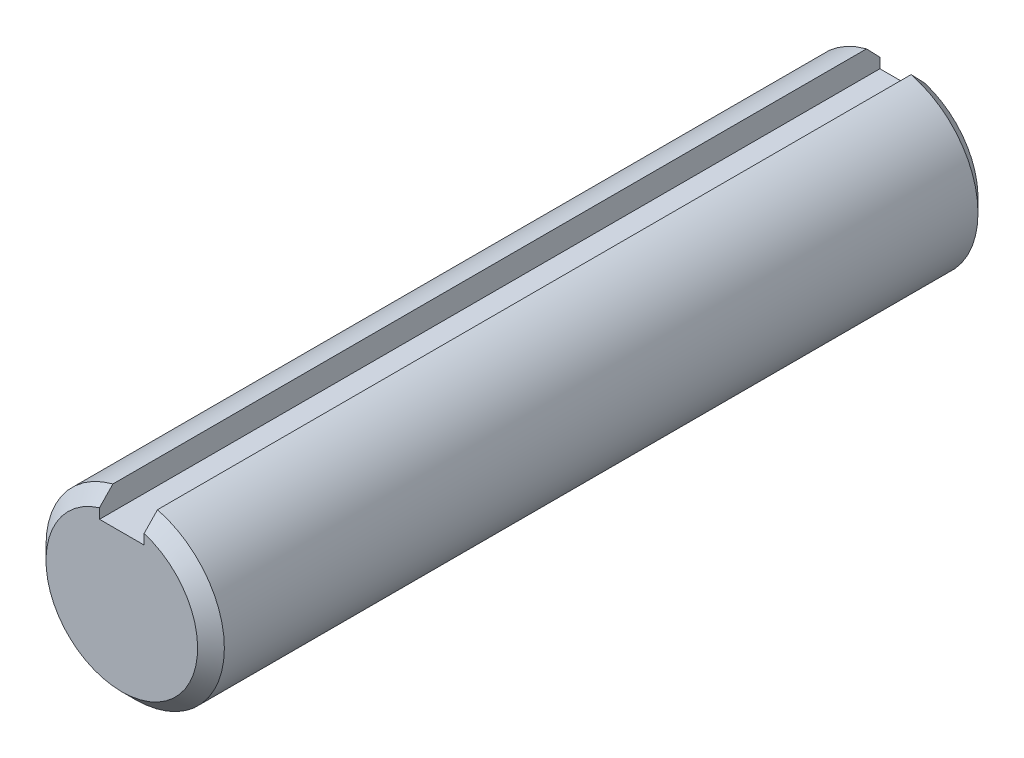
ISO-10303-21;
HEADER;
FILE_DESCRIPTION(('STEP AP214'),'2;1');
FILE_NAME('part.step','',(''),(''),'','','');
FILE_SCHEMA(('AUTOMOTIVE_DESIGN { 1 0 10303 214 1 1 1 1 }'));
ENDSEC;
DATA;
#1=APPLICATION_CONTEXT('core data for automotive mechanical design processes');
#2=APPLICATION_PROTOCOL_DEFINITION('international standard','automotive_design',2000,#1);
#3=PRODUCT_CONTEXT('',#1,'mechanical');
#4=PRODUCT('Part','Part','',(#3));
#5=PRODUCT_RELATED_PRODUCT_CATEGORY('part','',(#4));
#6=PRODUCT_DEFINITION_FORMATION('','',#4);
#7=PRODUCT_DEFINITION_CONTEXT('part definition',#1,'design');
#8=PRODUCT_DEFINITION('design','',#6,#7);
#9=PRODUCT_DEFINITION_SHAPE('','',#8);
#10=(LENGTH_UNIT() NAMED_UNIT(*) SI_UNIT(.MILLI.,.METRE.));
#11=(NAMED_UNIT(*) PLANE_ANGLE_UNIT() SI_UNIT($,.RADIAN.));
#12=(NAMED_UNIT(*) SI_UNIT($,.STERADIAN.) SOLID_ANGLE_UNIT());
#13=UNCERTAINTY_MEASURE_WITH_UNIT(LENGTH_MEASURE(1.E-05),#10,'distance_accuracy_value','');
#14=(GEOMETRIC_REPRESENTATION_CONTEXT(3) GLOBAL_UNCERTAINTY_ASSIGNED_CONTEXT((#13)) GLOBAL_UNIT_ASSIGNED_CONTEXT((#10,
#11,#12)) REPRESENTATION_CONTEXT('',''));
#15=CARTESIAN_POINT('',(0.,0.,0.));
#16=DIRECTION('',(0.,0.,1.));
#17=DIRECTION('',(1.,0.,0.));
#18=AXIS2_PLACEMENT_3D('',#15,#16,#17);
#19=CARTESIAN_POINT('',(0.,0.,17.5));
#20=DIRECTION('',(0.,0.,-1.));
#21=DIRECTION('',(-1.,0.,0.));
#22=AXIS2_PLACEMENT_3D('',#19,#20,#21);
#23=CYLINDRICAL_SURFACE('',#22,4.);
#24=CARTESIAN_POINT('',(0.,0.,16.9));
#25=DIRECTION('',(0.,0.,1.));
#26=DIRECTION('',(1.,0.,0.));
#27=AXIS2_PLACEMENT_3D('',#24,#25,#26);
#28=CIRCLE('',#27,4.);
#29=CARTESIAN_POINT('',(1.,3.87298334620742,16.9));
#30=VERTEX_POINT('',#29);
#31=CARTESIAN_POINT('',(-1.,3.87298334620742,16.9));
#32=VERTEX_POINT('',#31);
#33=EDGE_CURVE('E152',#30,#32,#28,.F.);
#34=ORIENTED_EDGE('',*,*,#33,.T.);
#35=DIRECTION('',(0.,0.,-1.));
#36=VECTOR('',#35,1.);
#37=CARTESIAN_POINT('',(-1.,3.87298334620742,17.5));
#38=LINE('',#37,#36);
#39=CARTESIAN_POINT('',(-1.,3.87298334620742,-16.9));
#40=VERTEX_POINT('',#39);
#41=EDGE_CURVE('E130',#32,#40,#38,.T.);
#42=ORIENTED_EDGE('',*,*,#41,.T.);
#43=CARTESIAN_POINT('',(0.,0.,-16.9));
#44=DIRECTION('',(0.,0.,1.));
#45=DIRECTION('',(1.,0.,0.));
#46=AXIS2_PLACEMENT_3D('',#43,#44,#45);
#47=CIRCLE('',#46,4.);
#48=CARTESIAN_POINT('',(1.,3.87298334620742,-16.9));
#49=VERTEX_POINT('',#48);
#50=EDGE_CURVE('E149',#40,#49,#47,.T.);
#51=ORIENTED_EDGE('',*,*,#50,.T.);
#52=DIRECTION('',(0.,0.,-1.));
#53=VECTOR('',#52,1.);
#54=CARTESIAN_POINT('',(1.,3.87298334620742,17.5));
#55=LINE('',#54,#53);
#56=EDGE_CURVE('E120',#49,#30,#55,.F.);
#57=ORIENTED_EDGE('',*,*,#56,.T.);
#58=EDGE_LOOP('',(#34,#42,#51,#57));
#59=FACE_BOUND('',#58,.T.);
#60=ADVANCED_FACE('F35',(#59),#23,.T.);
#61=CARTESIAN_POINT('',(0.,0.,17.5));
#62=DIRECTION('',(0.,0.,1.));
#63=DIRECTION('',(1.,0.,0.));
#64=AXIS2_PLACEMENT_3D('',#61,#62,#63);
#65=PLANE('',#64);
#66=DIRECTION('',(0.,-1.,0.));
#67=VECTOR('',#66,1.);
#68=CARTESIAN_POINT('',(-1.,4.,17.5));
#69=LINE('',#68,#67);
#70=CARTESIAN_POINT('',(-1.,3.24961536185438,17.5));
#71=VERTEX_POINT('',#70);
#72=CARTESIAN_POINT('',(-1.,2.8,17.5));
#73=VERTEX_POINT('',#72);
#74=EDGE_CURVE('E90',#71,#73,#69,.T.);
#75=ORIENTED_EDGE('',*,*,#74,.F.);
#76=CARTESIAN_POINT('',(0.,0.,17.5));
#77=DIRECTION('',(0.,0.,1.));
#78=DIRECTION('',(1.,0.,0.));
#79=AXIS2_PLACEMENT_3D('',#76,#77,#78);
#80=CIRCLE('',#79,3.4);
#81=CARTESIAN_POINT('',(1.,3.24961536185438,17.5));
#82=VERTEX_POINT('',#81);
#83=EDGE_CURVE('E144',#71,#82,#80,.T.);
#84=ORIENTED_EDGE('',*,*,#83,.T.);
#85=DIRECTION('',(0.,1.,0.));
#86=VECTOR('',#85,1.);
#87=CARTESIAN_POINT('',(1.,4.,17.5));
#88=LINE('',#87,#86);
#89=CARTESIAN_POINT('',(1.,2.8,17.5));
#90=VERTEX_POINT('',#89);
#91=EDGE_CURVE('E55',#90,#82,#88,.T.);
#92=ORIENTED_EDGE('',*,*,#91,.F.);
#93=DIRECTION('',(1.,0.,0.));
#94=VECTOR('',#93,1.);
#95=CARTESIAN_POINT('',(-1.,2.8,17.5));
#96=LINE('',#95,#94);
#97=EDGE_CURVE('E100',#73,#90,#96,.T.);
#98=ORIENTED_EDGE('',*,*,#97,.F.);
#99=EDGE_LOOP('',(#75,#84,#92,#98));
#100=FACE_BOUND('',#99,.T.);
#101=ADVANCED_FACE('F111',(#100),#65,.T.);
#102=CARTESIAN_POINT('',(0.,0.,-17.5));
#103=DIRECTION('',(0.,0.,1.));
#104=DIRECTION('',(1.,0.,0.));
#105=AXIS2_PLACEMENT_3D('',#102,#103,#104);
#106=PLANE('',#105);
#107=CARTESIAN_POINT('',(0.,0.,-17.5));
#108=DIRECTION('',(0.,0.,1.));
#109=DIRECTION('',(1.,0.,0.));
#110=AXIS2_PLACEMENT_3D('',#107,#108,#109);
#111=CIRCLE('',#110,3.39999999999999);
#112=CARTESIAN_POINT('',(1.,3.24961536185437,-17.5));
#113=VERTEX_POINT('',#112);
#114=CARTESIAN_POINT('',(-1.,3.24961536185437,-17.5));
#115=VERTEX_POINT('',#114);
#116=EDGE_CURVE('E146',#113,#115,#111,.F.);
#117=ORIENTED_EDGE('',*,*,#116,.T.);
#118=DIRECTION('',(0.,-1.,0.));
#119=VECTOR('',#118,1.);
#120=CARTESIAN_POINT('',(-1.,4.,-17.5));
#121=LINE('',#120,#119);
#122=CARTESIAN_POINT('',(-1.,2.8,-17.5));
#123=VERTEX_POINT('',#122);
#124=EDGE_CURVE('E113',#115,#123,#121,.T.);
#125=ORIENTED_EDGE('',*,*,#124,.T.);
#126=DIRECTION('',(1.,0.,0.));
#127=VECTOR('',#126,1.);
#128=CARTESIAN_POINT('',(-1.,2.8,-17.5));
#129=LINE('',#128,#127);
#130=CARTESIAN_POINT('',(1.,2.8,-17.5));
#131=VERTEX_POINT('',#130);
#132=EDGE_CURVE('E106',#123,#131,#129,.T.);
#133=ORIENTED_EDGE('',*,*,#132,.T.);
#134=DIRECTION('',(0.,1.,0.));
#135=VECTOR('',#134,1.);
#136=CARTESIAN_POINT('',(1.,4.,-17.5));
#137=LINE('',#136,#135);
#138=EDGE_CURVE('E109',#131,#113,#137,.T.);
#139=ORIENTED_EDGE('',*,*,#138,.T.);
#140=EDGE_LOOP('',(#117,#125,#133,#139));
#141=FACE_BOUND('',#140,.T.);
#142=ADVANCED_FACE('F163',(#141),#106,.F.);
#143=CARTESIAN_POINT('',(0.,0.,-16.9));
#144=DIRECTION('',(0.,0.,1.));
#145=DIRECTION('',(1.,0.,0.));
#146=AXIS2_PLACEMENT_3D('',#143,#144,#145);
#147=CONICAL_SURFACE('',#146,4.,0.785398163397448);
#148=CARTESIAN_POINT('',(-1.,1.35081586044512,-19.2193145776707));
#149=CARTESIAN_POINT('',(-1.,1.41488066306063,-19.1677819180893));
#150=CARTESIAN_POINT('',(-1.,1.47834718315388,-19.1155190121442));
#151=CARTESIAN_POINT('',(-1.,1.60431909726052,-19.0098610895691));
#152=CARTESIAN_POINT('',(-1.,1.66682460819919,-18.9564662125761));
#153=CARTESIAN_POINT('',(-1.,1.79110830645551,-18.8488748489054));
#154=CARTESIAN_POINT('',(-1.,1.85288669062793,-18.7946785885892));
#155=CARTESIAN_POINT('',(-1.,1.97588779267709,-18.6856554471097));
#156=CARTESIAN_POINT('',(-1.,2.03711049082799,-18.6308285437153));
#157=CARTESIAN_POINT('',(-1.,2.22007183752193,-18.4656732576281));
#158=CARTESIAN_POINT('',(-1.,2.34115805740112,-18.3546228023411));
#159=CARTESIAN_POINT('',(-1.,2.58220273418877,-18.1312938836685));
#160=CARTESIAN_POINT('',(-1.,2.70216111581648,-18.0190153393776));
#161=CARTESIAN_POINT('',(-1.,2.90589091931234,-17.8269857063987));
#162=CARTESIAN_POINT('',(-1.,2.98986154396475,-17.7474457040524));
#163=CARTESIAN_POINT('',(-1.,3.15749767385886,-17.5880337926722));
#164=CARTESIAN_POINT('',(-1.,3.24116315833901,-17.5081618618169));
#165=CARTESIAN_POINT('',(-1.,3.48509842555487,-17.2745671002813));
#166=CARTESIAN_POINT('',(-1.,3.64503682524598,-17.1204983050087));
#167=CARTESIAN_POINT('',(-1.,3.96429640051124,-16.811722329736));
#168=CARTESIAN_POINT('',(-1.,4.1236175738643,-16.6570151474428));
#169=CARTESIAN_POINT('',(-1.,4.44177985420495,-16.3471885210976));
#170=CARTESIAN_POINT('',(-1.,4.60062107239222,-16.1920691911779));
#171=CARTESIAN_POINT('',(-1.,4.91797030091099,-15.8814935510322));
#172=CARTESIAN_POINT('',(-1.,5.07647831497418,-15.7260372446202));
#173=CARTESIAN_POINT('',(-1.,5.23487471717617,-15.5704678156023));
#174=B_SPLINE_CURVE_WITH_KNOTS('',3,(#148,#149,#150,#151,#152,#153,#154,#155,#156,#157,#158,
#159,#160,#161,#162,#163,#164,#165,#166,#167,#168,#169,#170,#171,#172,#173),.UNSPECIFIED.,.F.,
.F.,(4,2,2,2,2,2,2,2,2,2,2,2,4),(0.,0.246638527108011,0.493246804550317,0.73978670666486,
0.98633532653122,1.47921612753496,1.97212959697097,2.31911430749398,2.66612220192963,
3.332345371537,3.99857093633251,4.6646280446703,5.33067765339345),.UNSPECIFIED.);
#175=EDGE_CURVE('E63',#115,#40,#174,.T.);
#176=ORIENTED_EDGE('',*,*,#175,.F.);
#177=ORIENTED_EDGE('',*,*,#116,.F.);
#178=CARTESIAN_POINT('',(1.,5.23487471717617,-15.5704678156023));
#179=CARTESIAN_POINT('',(1.,5.07642976511734,-15.7260850635911));
#180=CARTESIAN_POINT('',(1.,4.91787303822036,-15.8815890063281));
#181=CARTESIAN_POINT('',(1.,4.60043442524243,-16.1922515783813));
#182=CARTESIAN_POINT('',(1.,4.44155255272162,-16.3474102215566));
#183=CARTESIAN_POINT('',(1.,4.12339792056105,-16.6572286939957));
#184=CARTESIAN_POINT('',(1.,3.96412529582628,-16.8118886617124));
#185=CARTESIAN_POINT('',(1.,3.64495454195615,-17.1205770374935));
#186=CARTESIAN_POINT('',(1.,3.48505638500136,-17.2746054168307));
#187=CARTESIAN_POINT('',(1.,3.16427810361861,-17.5817896736052));
#188=CARTESIAN_POINT('',(1.,3.00339754942277,-17.7349451025749));
#189=CARTESIAN_POINT('',(1.,2.68026393133356,-18.0397741705045));
#190=CARTESIAN_POINT('',(1.,2.51801101305171,-18.1914479630795));
#191=CARTESIAN_POINT('',(1.,2.27284509960379,-18.4170936253633));
#192=CARTESIAN_POINT('',(1.,2.19080682391783,-18.4920145563211));
#193=CARTESIAN_POINT('',(1.,2.02594222380101,-18.6409764949062));
#194=CARTESIAN_POINT('',(1.,1.94311594332784,-18.7150175511038));
#195=CARTESIAN_POINT('',(1.,1.77634824406914,-18.8619013656389));
#196=CARTESIAN_POINT('',(1.,1.69240642828068,-18.9347436755316));
#197=CARTESIAN_POINT('',(1.,1.56532637426185,-19.0426501770363));
#198=CARTESIAN_POINT('',(1.,1.52276776255762,-19.0783961330172));
#199=CARTESIAN_POINT('',(1.,1.43717223649483,-19.1493154130559));
#200=CARTESIAN_POINT('',(1.,1.39413529386853,-19.1844887029652));
#201=CARTESIAN_POINT('',(1.,1.35081586044512,-19.2193145776707));
#202=B_SPLINE_CURVE_WITH_KNOTS('',3,(#178,#179,#180,#181,#182,#183,#184,#185,#186,#187,#188,
#189,#190,#191,#192,#193,#194,#195,#196,#197,#198,#199,#200,#201),.UNSPECIFIED.,.F.,.F.,(4,2,2,
2,2,2,2,2,2,2,2,4),(0.,0.66625401987663,1.33248079806412,1.9985031425817,2.66455545185874,
3.33092366291565,3.99722203595525,4.33052034592894,4.66380017110566,4.99720196323079,
5.16393407836719,5.3306760997552),.UNSPECIFIED.);
#203=EDGE_CURVE('E124',#49,#113,#202,.T.);
#204=ORIENTED_EDGE('',*,*,#203,.F.);
#205=ORIENTED_EDGE('',*,*,#50,.F.);
#206=EDGE_LOOP('',(#176,#177,#204,#205));
#207=FACE_BOUND('',#206,.T.);
#208=ADVANCED_FACE('F132',(#207),#147,.T.);
#209=CARTESIAN_POINT('',(0.,0.,17.5));
#210=DIRECTION('',(0.,0.,-1.));
#211=DIRECTION('',(-1.,0.,0.));
#212=AXIS2_PLACEMENT_3D('',#209,#210,#211);
#213=CONICAL_SURFACE('',#212,3.4,0.785398163397448);
#214=CARTESIAN_POINT('',(-1.,5.23487471717617,15.5704678156024));
#215=CARTESIAN_POINT('',(-1.,5.07642976511733,15.7260850635911));
#216=CARTESIAN_POINT('',(-1.,4.91787303822035,15.8815890063281));
#217=CARTESIAN_POINT('',(-1.,4.60043442524243,16.1922515783813));
#218=CARTESIAN_POINT('',(-1.,4.44155255272162,16.3474102215566));
#219=CARTESIAN_POINT('',(-1.,4.12339792056104,16.6572286939957));
#220=CARTESIAN_POINT('',(-1.,3.96412529582627,16.8118886617124));
#221=CARTESIAN_POINT('',(-1.,3.64495454195615,17.1205770374935));
#222=CARTESIAN_POINT('',(-1.,3.48505638500136,17.2746054168307));
#223=CARTESIAN_POINT('',(-1.,3.16427810361861,17.5817896736052));
#224=CARTESIAN_POINT('',(-1.,3.00339754942277,17.7349451025749));
#225=CARTESIAN_POINT('',(-1.,2.68026393133356,18.0397741705045));
#226=CARTESIAN_POINT('',(-1.,2.51801101305172,18.1914479630795));
#227=CARTESIAN_POINT('',(-1.,2.27284509960379,18.4170936253633));
#228=CARTESIAN_POINT('',(-1.,2.19080682391783,18.4920145563211));
#229=CARTESIAN_POINT('',(-1.,2.02594222380101,18.6409764949062));
#230=CARTESIAN_POINT('',(-1.,1.94311594332784,18.7150175511038));
#231=CARTESIAN_POINT('',(-1.,1.77634824406914,18.8619013656389));
#232=CARTESIAN_POINT('',(-1.,1.69240642828068,18.9347436755316));
#233=CARTESIAN_POINT('',(-1.,1.56532637426186,19.0426501770363));
#234=CARTESIAN_POINT('',(-1.,1.52276776255763,19.0783961330172));
#235=CARTESIAN_POINT('',(-1.,1.43717223649483,19.1493154130559));
#236=CARTESIAN_POINT('',(-1.,1.39413529386854,19.1844887029652));
#237=CARTESIAN_POINT('',(-1.,1.35081586044513,19.2193145776707));
#238=B_SPLINE_CURVE_WITH_KNOTS('',3,(#214,#215,#216,#217,#218,#219,#220,#221,#222,#223,#224,
#225,#226,#227,#228,#229,#230,#231,#232,#233,#234,#235,#236,#237),.UNSPECIFIED.,.F.,.F.,(4,2,2,
2,2,2,2,2,2,2,2,4),(0.,0.666254019876632,1.33248079806412,1.9985031425817,2.66455545185874,
3.33092366291565,3.99722203595525,4.33052034592893,4.66380017110566,4.99720196323078,
5.16393407836718,5.33067609975519),.UNSPECIFIED.);
#239=EDGE_CURVE('E11',#32,#71,#238,.T.);
#240=ORIENTED_EDGE('',*,*,#239,.F.);
#241=ORIENTED_EDGE('',*,*,#33,.F.);
#242=CARTESIAN_POINT('',(1.,1.35081586044513,19.2193145776707));
#243=CARTESIAN_POINT('',(1.,1.41488066306063,19.1677819180893));
#244=CARTESIAN_POINT('',(1.,1.47834718315389,19.1155190121442));
#245=CARTESIAN_POINT('',(1.,1.60431909726053,19.0098610895691));
#246=CARTESIAN_POINT('',(1.,1.66682460819919,18.9564662125761));
#247=CARTESIAN_POINT('',(1.,1.79110830645551,18.8488748489054));
#248=CARTESIAN_POINT('',(1.,1.85288669062794,18.7946785885892));
#249=CARTESIAN_POINT('',(1.,1.97588779267709,18.6856554471097));
#250=CARTESIAN_POINT('',(1.,2.03711049082799,18.6308285437153));
#251=CARTESIAN_POINT('',(1.,2.22007183752194,18.4656732576281));
#252=CARTESIAN_POINT('',(1.,2.34115805740112,18.3546228023411));
#253=CARTESIAN_POINT('',(1.,2.58220273418877,18.1312938836685));
#254=CARTESIAN_POINT('',(1.,2.70216111581649,18.0190153393776));
#255=CARTESIAN_POINT('',(1.,2.90589091931234,17.8269857063987));
#256=CARTESIAN_POINT('',(1.,2.98986154396476,17.7474457040524));
#257=CARTESIAN_POINT('',(1.,3.15749767385886,17.5880337926722));
#258=CARTESIAN_POINT('',(1.,3.24116315833901,17.5081618618169));
#259=CARTESIAN_POINT('',(1.,3.48509842555487,17.2745671002813));
#260=CARTESIAN_POINT('',(1.,3.64503682524598,17.1204983050087));
#261=CARTESIAN_POINT('',(1.,3.96429640051124,16.811722329736));
#262=CARTESIAN_POINT('',(1.,4.1236175738643,16.6570151474428));
#263=CARTESIAN_POINT('',(1.,4.44177985420495,16.3471885210976));
#264=CARTESIAN_POINT('',(1.,4.60062107239221,16.1920691911779));
#265=CARTESIAN_POINT('',(1.,4.91797030091098,15.8814935510322));
#266=CARTESIAN_POINT('',(1.,5.07647831497417,15.7260372446202));
#267=CARTESIAN_POINT('',(1.,5.23487471717617,15.5704678156024));
#268=B_SPLINE_CURVE_WITH_KNOTS('',3,(#242,#243,#244,#245,#246,#247,#248,#249,#250,#251,#252,
#253,#254,#255,#256,#257,#258,#259,#260,#261,#262,#263,#264,#265,#266,#267),.UNSPECIFIED.,.F.,
.F.,(4,2,2,2,2,2,2,2,2,2,2,2,4),(0.,0.246638527108011,0.493246804550317,0.739786706664863,
0.986335326531219,1.47921612753496,1.97212959697097,2.31911430749398,2.66612220192962,
3.33234537153699,3.9985709363325,4.66462804467029,5.33067765339344),.UNSPECIFIED.);
#269=EDGE_CURVE('E48',#82,#30,#268,.T.);
#270=ORIENTED_EDGE('',*,*,#269,.F.);
#271=ORIENTED_EDGE('',*,*,#83,.F.);
#272=EDGE_LOOP('',(#240,#241,#270,#271));
#273=FACE_BOUND('',#272,.T.);
#274=ADVANCED_FACE('F37',(#273),#213,.T.);
#275=CARTESIAN_POINT('',(-1.,4.,-17.5));
#276=DIRECTION('',(-1.,0.,0.));
#277=DIRECTION('',(0.,-1.,0.));
#278=AXIS2_PLACEMENT_3D('',#275,#276,#277);
#279=PLANE('',#278);
#280=ORIENTED_EDGE('',*,*,#175,.T.);
#281=ORIENTED_EDGE('',*,*,#41,.F.);
#282=ORIENTED_EDGE('',*,*,#239,.T.);
#283=ORIENTED_EDGE('',*,*,#74,.T.);
#284=DIRECTION('',(0.,0.,1.));
#285=VECTOR('',#284,1.);
#286=CARTESIAN_POINT('',(-1.,2.8,-17.5));
#287=LINE('',#286,#285);
#288=EDGE_CURVE('E93',#123,#73,#287,.T.);
#289=ORIENTED_EDGE('',*,*,#288,.F.);
#290=ORIENTED_EDGE('',*,*,#124,.F.);
#291=EDGE_LOOP('',(#280,#281,#282,#283,#289,#290));
#292=FACE_BOUND('',#291,.T.);
#293=ADVANCED_FACE('F92',(#292),#279,.F.);
#294=CARTESIAN_POINT('',(1.,4.,-17.5));
#295=DIRECTION('',(1.,0.,0.));
#296=DIRECTION('',(0.,1.,0.));
#297=AXIS2_PLACEMENT_3D('',#294,#295,#296);
#298=PLANE('',#297);
#299=ORIENTED_EDGE('',*,*,#203,.T.);
#300=ORIENTED_EDGE('',*,*,#138,.F.);
#301=DIRECTION('',(0.,0.,1.));
#302=VECTOR('',#301,1.);
#303=CARTESIAN_POINT('',(1.,2.8,-17.5));
#304=LINE('',#303,#302);
#305=EDGE_CURVE('E108',#131,#90,#304,.T.);
#306=ORIENTED_EDGE('',*,*,#305,.T.);
#307=ORIENTED_EDGE('',*,*,#91,.T.);
#308=ORIENTED_EDGE('',*,*,#269,.T.);
#309=ORIENTED_EDGE('',*,*,#56,.F.);
#310=EDGE_LOOP('',(#299,#300,#306,#307,#308,#309));
#311=FACE_BOUND('',#310,.T.);
#312=ADVANCED_FACE('F135',(#311),#298,.F.);
#313=CARTESIAN_POINT('',(-1.,2.8,-17.5));
#314=DIRECTION('',(0.,-1.,0.));
#315=DIRECTION('',(0.,0.,-1.));
#316=AXIS2_PLACEMENT_3D('',#313,#314,#315);
#317=PLANE('',#316);
#318=ORIENTED_EDGE('',*,*,#305,.F.);
#319=ORIENTED_EDGE('',*,*,#132,.F.);
#320=ORIENTED_EDGE('',*,*,#288,.T.);
#321=ORIENTED_EDGE('',*,*,#97,.T.);
#322=EDGE_LOOP('',(#318,#319,#320,#321));
#323=FACE_BOUND('',#322,.T.);
#324=ADVANCED_FACE('F104',(#323),#317,.F.);
#325=CLOSED_SHELL('',(#60,#101,#142,#208,#274,#293,#312,#324));
#326=MANIFOLD_SOLID_BREP('B2',#325);
#327=ADVANCED_BREP_SHAPE_REPRESENTATION('',(#18,#326),#14);
#328=SHAPE_DEFINITION_REPRESENTATION(#9,#327);
ENDSEC;
END-ISO-10303-21;
